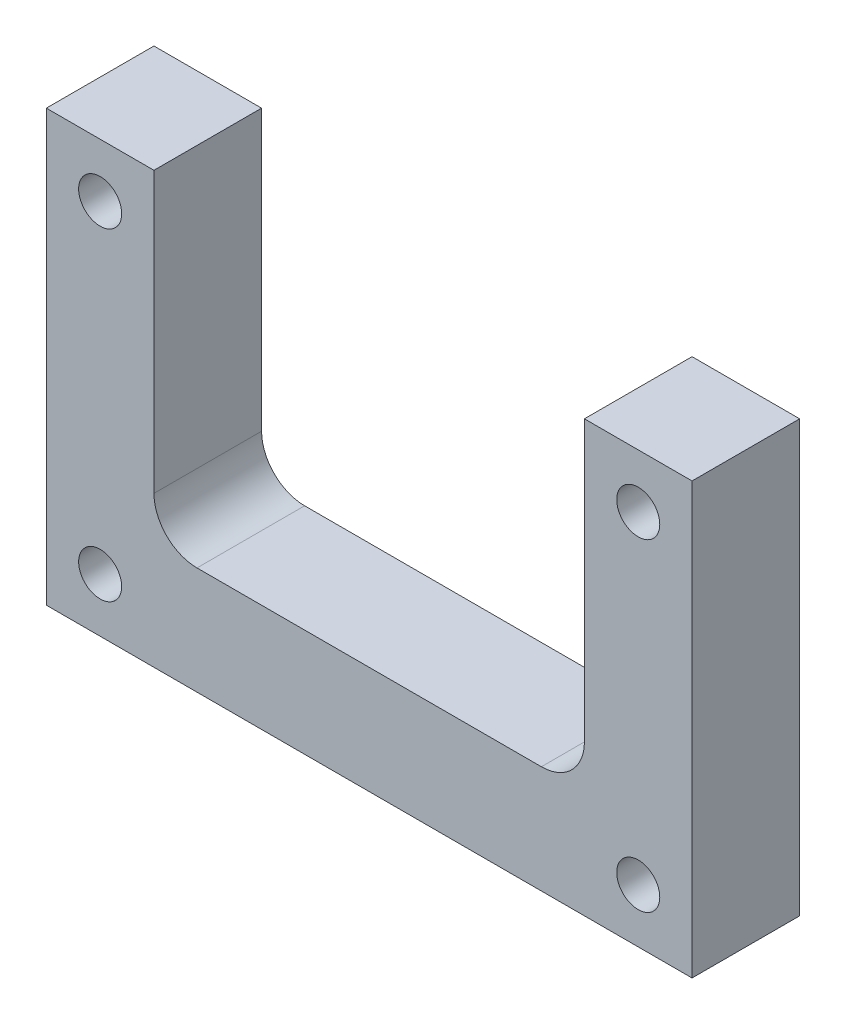
ISO-10303-21;
HEADER;
FILE_DESCRIPTION(('STEP AP214'),'2;1');
FILE_NAME('part.step','',(''),(''),'','','');
FILE_SCHEMA(('AUTOMOTIVE_DESIGN { 1 0 10303 214 1 1 1 1 }'));
ENDSEC;
DATA;
#1=APPLICATION_CONTEXT('core data for automotive mechanical design processes');
#2=APPLICATION_PROTOCOL_DEFINITION('international standard','automotive_design',2000,#1);
#3=PRODUCT_CONTEXT('',#1,'mechanical');
#4=PRODUCT('Part','Part','',(#3));
#5=PRODUCT_RELATED_PRODUCT_CATEGORY('part','',(#4));
#6=PRODUCT_DEFINITION_FORMATION('','',#4);
#7=PRODUCT_DEFINITION_CONTEXT('part definition',#1,'design');
#8=PRODUCT_DEFINITION('design','',#6,#7);
#9=PRODUCT_DEFINITION_SHAPE('','',#8);
#10=(LENGTH_UNIT() NAMED_UNIT(*) SI_UNIT(.MILLI.,.METRE.));
#11=(NAMED_UNIT(*) PLANE_ANGLE_UNIT() SI_UNIT($,.RADIAN.));
#12=(NAMED_UNIT(*) SI_UNIT($,.STERADIAN.) SOLID_ANGLE_UNIT());
#13=UNCERTAINTY_MEASURE_WITH_UNIT(LENGTH_MEASURE(1.E-05),#10,'distance_accuracy_value','');
#14=(GEOMETRIC_REPRESENTATION_CONTEXT(3) GLOBAL_UNCERTAINTY_ASSIGNED_CONTEXT((#13)) GLOBAL_UNIT_ASSIGNED_CONTEXT((#10,
#11,#12)) REPRESENTATION_CONTEXT('',''));
#15=CARTESIAN_POINT('',(0.,0.,0.));
#16=DIRECTION('',(0.,0.,1.));
#17=DIRECTION('',(1.,0.,0.));
#18=AXIS2_PLACEMENT_3D('',#15,#16,#17);
#19=CARTESIAN_POINT('',(38.1,25.4,12.7));
#20=DIRECTION('',(-1.,0.,0.));
#21=DIRECTION('',(0.,-1.,0.));
#22=AXIS2_PLACEMENT_3D('',#19,#20,#21);
#23=PLANE('',#22);
#24=DIRECTION('',(0.,1.,0.));
#25=VECTOR('',#24,1.);
#26=CARTESIAN_POINT('',(38.1,25.4,0.));
#27=LINE('',#26,#25);
#28=CARTESIAN_POINT('',(38.1,-25.4,0.));
#29=VERTEX_POINT('',#28);
#30=CARTESIAN_POINT('',(38.1,25.4,0.));
#31=VERTEX_POINT('',#30);
#32=EDGE_CURVE('E144',#29,#31,#27,.T.);
#33=ORIENTED_EDGE('',*,*,#32,.T.);
#34=DIRECTION('',(0.,0.,-1.));
#35=VECTOR('',#34,1.);
#36=CARTESIAN_POINT('',(38.1,25.4,12.7));
#37=LINE('',#36,#35);
#38=CARTESIAN_POINT('',(38.1,25.4,12.7));
#39=VERTEX_POINT('',#38);
#40=EDGE_CURVE('E123',#39,#31,#37,.T.);
#41=ORIENTED_EDGE('',*,*,#40,.F.);
#42=DIRECTION('',(0.,1.,0.));
#43=VECTOR('',#42,1.);
#44=CARTESIAN_POINT('',(38.1,25.4,12.7));
#45=LINE('',#44,#43);
#46=CARTESIAN_POINT('',(38.1,-25.4,12.7));
#47=VERTEX_POINT('',#46);
#48=EDGE_CURVE('E131',#47,#39,#45,.T.);
#49=ORIENTED_EDGE('',*,*,#48,.F.);
#50=DIRECTION('',(0.,0.,-1.));
#51=VECTOR('',#50,1.);
#52=CARTESIAN_POINT('',(38.1,-25.4,12.7));
#53=LINE('',#52,#51);
#54=EDGE_CURVE('E224',#47,#29,#53,.T.);
#55=ORIENTED_EDGE('',*,*,#54,.T.);
#56=EDGE_LOOP('',(#33,#41,#49,#55));
#57=FACE_BOUND('',#56,.T.);
#58=ADVANCED_FACE('F42',(#57),#23,.F.);
#59=CARTESIAN_POINT('',(25.4,25.4,12.7));
#60=DIRECTION('',(0.,-1.,0.));
#61=DIRECTION('',(0.,0.,-1.));
#62=AXIS2_PLACEMENT_3D('',#59,#60,#61);
#63=PLANE('',#62);
#64=DIRECTION('',(-1.,0.,0.));
#65=VECTOR('',#64,1.);
#66=CARTESIAN_POINT('',(25.4,25.4,0.));
#67=LINE('',#66,#65);
#68=CARTESIAN_POINT('',(25.4,25.4,0.));
#69=VERTEX_POINT('',#68);
#70=EDGE_CURVE('E227',#31,#69,#67,.T.);
#71=ORIENTED_EDGE('',*,*,#70,.T.);
#72=DIRECTION('',(0.,0.,-1.));
#73=VECTOR('',#72,1.);
#74=CARTESIAN_POINT('',(25.4,25.4,12.7));
#75=LINE('',#74,#73);
#76=CARTESIAN_POINT('',(25.4,25.4,12.7));
#77=VERTEX_POINT('',#76);
#78=EDGE_CURVE('E126',#77,#69,#75,.T.);
#79=ORIENTED_EDGE('',*,*,#78,.F.);
#80=DIRECTION('',(-1.,0.,0.));
#81=VECTOR('',#80,1.);
#82=CARTESIAN_POINT('',(25.4,25.4,12.7));
#83=LINE('',#82,#81);
#84=EDGE_CURVE('E119',#39,#77,#83,.T.);
#85=ORIENTED_EDGE('',*,*,#84,.F.);
#86=ORIENTED_EDGE('',*,*,#40,.T.);
#87=EDGE_LOOP('',(#71,#79,#85,#86));
#88=FACE_BOUND('',#87,.T.);
#89=ADVANCED_FACE('F121',(#88),#63,.F.);
#90=CARTESIAN_POINT('',(25.4,-12.7,12.7));
#91=DIRECTION('',(1.,0.,0.));
#92=DIRECTION('',(0.,1.,0.));
#93=AXIS2_PLACEMENT_3D('',#90,#91,#92);
#94=PLANE('',#93);
#95=DIRECTION('',(0.,-1.,0.));
#96=VECTOR('',#95,1.);
#97=CARTESIAN_POINT('',(25.4,-12.7,0.));
#98=LINE('',#97,#96);
#99=CARTESIAN_POINT('',(25.4,-7.62,0.));
#100=VERTEX_POINT('',#99);
#101=EDGE_CURVE('E201',#69,#100,#98,.T.);
#102=ORIENTED_EDGE('',*,*,#101,.T.);
#103=DIRECTION('',(0.,0.,-1.));
#104=VECTOR('',#103,1.);
#105=CARTESIAN_POINT('',(25.4,-7.62,12.7));
#106=LINE('',#105,#104);
#107=CARTESIAN_POINT('',(25.4,-7.62,12.7));
#108=VERTEX_POINT('',#107);
#109=EDGE_CURVE('E176',#100,#108,#106,.F.);
#110=ORIENTED_EDGE('',*,*,#109,.T.);
#111=DIRECTION('',(0.,-1.,0.));
#112=VECTOR('',#111,1.);
#113=CARTESIAN_POINT('',(25.4,-12.7,12.7));
#114=LINE('',#113,#112);
#115=EDGE_CURVE('E130',#77,#108,#114,.T.);
#116=ORIENTED_EDGE('',*,*,#115,.F.);
#117=ORIENTED_EDGE('',*,*,#78,.T.);
#118=EDGE_LOOP('',(#102,#110,#116,#117));
#119=FACE_BOUND('',#118,.T.);
#120=ADVANCED_FACE('F266',(#119),#94,.F.);
#121=CARTESIAN_POINT('',(-25.4,-12.7,12.7));
#122=DIRECTION('',(0.,-1.,0.));
#123=DIRECTION('',(1.,0.,0.));
#124=AXIS2_PLACEMENT_3D('',#121,#122,#123);
#125=PLANE('',#124);
#126=DIRECTION('',(-1.,0.,0.));
#127=VECTOR('',#126,1.);
#128=CARTESIAN_POINT('',(-25.4,-12.7,12.7));
#129=LINE('',#128,#127);
#130=CARTESIAN_POINT('',(20.32,-12.7,12.7));
#131=VERTEX_POINT('',#130);
#132=CARTESIAN_POINT('',(-20.32,-12.7,12.7));
#133=VERTEX_POINT('',#132);
#134=EDGE_CURVE('E211',#131,#133,#129,.T.);
#135=ORIENTED_EDGE('',*,*,#134,.F.);
#136=DIRECTION('',(0.,0.,-1.));
#137=VECTOR('',#136,1.);
#138=CARTESIAN_POINT('',(20.32,-12.7,0.));
#139=LINE('',#138,#137);
#140=CARTESIAN_POINT('',(20.32,-12.7,0.));
#141=VERTEX_POINT('',#140);
#142=EDGE_CURVE('E150',#131,#141,#139,.T.);
#143=ORIENTED_EDGE('',*,*,#142,.T.);
#144=DIRECTION('',(-1.,0.,0.));
#145=VECTOR('',#144,1.);
#146=CARTESIAN_POINT('',(-25.4,-12.7,0.));
#147=LINE('',#146,#145);
#148=CARTESIAN_POINT('',(-20.32,-12.7,0.));
#149=VERTEX_POINT('',#148);
#150=EDGE_CURVE('E193',#141,#149,#147,.T.);
#151=ORIENTED_EDGE('',*,*,#150,.T.);
#152=DIRECTION('',(0.,0.,-1.));
#153=VECTOR('',#152,1.);
#154=CARTESIAN_POINT('',(-20.32,-12.7,12.7));
#155=LINE('',#154,#153);
#156=EDGE_CURVE('E146',#149,#133,#155,.F.);
#157=ORIENTED_EDGE('',*,*,#156,.T.);
#158=EDGE_LOOP('',(#135,#143,#151,#157));
#159=FACE_BOUND('',#158,.T.);
#160=ADVANCED_FACE('F198',(#159),#125,.F.);
#161=CARTESIAN_POINT('',(-25.4,25.4,12.7));
#162=DIRECTION('',(-1.,0.,0.));
#163=DIRECTION('',(0.,-1.,0.));
#164=AXIS2_PLACEMENT_3D('',#161,#162,#163);
#165=PLANE('',#164);
#166=DIRECTION('',(0.,1.,0.));
#167=VECTOR('',#166,1.);
#168=CARTESIAN_POINT('',(-25.4,25.4,12.7));
#169=LINE('',#168,#167);
#170=CARTESIAN_POINT('',(-25.4,-7.62,12.7));
#171=VERTEX_POINT('',#170);
#172=CARTESIAN_POINT('',(-25.4,25.4,12.7));
#173=VERTEX_POINT('',#172);
#174=EDGE_CURVE('E207',#171,#173,#169,.T.);
#175=ORIENTED_EDGE('',*,*,#174,.F.);
#176=DIRECTION('',(0.,0.,-1.));
#177=VECTOR('',#176,1.);
#178=CARTESIAN_POINT('',(-25.4,-7.62,0.));
#179=LINE('',#178,#177);
#180=CARTESIAN_POINT('',(-25.4,-7.62,0.));
#181=VERTEX_POINT('',#180);
#182=EDGE_CURVE('E179',#171,#181,#179,.T.);
#183=ORIENTED_EDGE('',*,*,#182,.T.);
#184=DIRECTION('',(0.,1.,0.));
#185=VECTOR('',#184,1.);
#186=CARTESIAN_POINT('',(-25.4,25.4,0.));
#187=LINE('',#186,#185);
#188=CARTESIAN_POINT('',(-25.4,25.4,0.));
#189=VERTEX_POINT('',#188);
#190=EDGE_CURVE('E195',#181,#189,#187,.T.);
#191=ORIENTED_EDGE('',*,*,#190,.T.);
#192=DIRECTION('',(0.,0.,-1.));
#193=VECTOR('',#192,1.);
#194=CARTESIAN_POINT('',(-25.4,25.4,12.7));
#195=LINE('',#194,#193);
#196=EDGE_CURVE('E152',#173,#189,#195,.T.);
#197=ORIENTED_EDGE('',*,*,#196,.F.);
#198=EDGE_LOOP('',(#175,#183,#191,#197));
#199=FACE_BOUND('',#198,.T.);
#200=ADVANCED_FACE('F204',(#199),#165,.F.);
#201=CARTESIAN_POINT('',(-38.1,25.4,12.7));
#202=DIRECTION('',(0.,-1.,0.));
#203=DIRECTION('',(0.,0.,-1.));
#204=AXIS2_PLACEMENT_3D('',#201,#202,#203);
#205=PLANE('',#204);
#206=DIRECTION('',(-1.,0.,0.));
#207=VECTOR('',#206,1.);
#208=CARTESIAN_POINT('',(-38.1,25.4,0.));
#209=LINE('',#208,#207);
#210=CARTESIAN_POINT('',(-38.1,25.4,0.));
#211=VERTEX_POINT('',#210);
#212=EDGE_CURVE('E235',#189,#211,#209,.T.);
#213=ORIENTED_EDGE('',*,*,#212,.T.);
#214=DIRECTION('',(0.,0.,-1.));
#215=VECTOR('',#214,1.);
#216=CARTESIAN_POINT('',(-38.1,25.4,12.7));
#217=LINE('',#216,#215);
#218=CARTESIAN_POINT('',(-38.1,25.4,12.7));
#219=VERTEX_POINT('',#218);
#220=EDGE_CURVE('E249',#219,#211,#217,.T.);
#221=ORIENTED_EDGE('',*,*,#220,.F.);
#222=DIRECTION('',(-1.,0.,0.));
#223=VECTOR('',#222,1.);
#224=CARTESIAN_POINT('',(-38.1,25.4,12.7));
#225=LINE('',#224,#223);
#226=EDGE_CURVE('E210',#173,#219,#225,.T.);
#227=ORIENTED_EDGE('',*,*,#226,.F.);
#228=ORIENTED_EDGE('',*,*,#196,.T.);
#229=EDGE_LOOP('',(#213,#221,#227,#228));
#230=FACE_BOUND('',#229,.T.);
#231=ADVANCED_FACE('F254',(#230),#205,.F.);
#232=CARTESIAN_POINT('',(-38.1,25.4,12.7));
#233=DIRECTION('',(1.,0.,0.));
#234=DIRECTION('',(0.,1.,0.));
#235=AXIS2_PLACEMENT_3D('',#232,#233,#234);
#236=PLANE('',#235);
#237=DIRECTION('',(0.,-1.,0.));
#238=VECTOR('',#237,1.);
#239=CARTESIAN_POINT('',(-38.1,25.4,0.));
#240=LINE('',#239,#238);
#241=CARTESIAN_POINT('',(-38.1,-25.4,0.));
#242=VERTEX_POINT('',#241);
#243=EDGE_CURVE('E238',#211,#242,#240,.T.);
#244=ORIENTED_EDGE('',*,*,#243,.T.);
#245=DIRECTION('',(0.,0.,-1.));
#246=VECTOR('',#245,1.);
#247=CARTESIAN_POINT('',(-38.1,-25.4,12.7));
#248=LINE('',#247,#246);
#249=CARTESIAN_POINT('',(-38.1,-25.4,12.7));
#250=VERTEX_POINT('',#249);
#251=EDGE_CURVE('E245',#250,#242,#248,.T.);
#252=ORIENTED_EDGE('',*,*,#251,.F.);
#253=DIRECTION('',(0.,-1.,0.));
#254=VECTOR('',#253,1.);
#255=CARTESIAN_POINT('',(-38.1,25.4,12.7));
#256=LINE('',#255,#254);
#257=EDGE_CURVE('E215',#219,#250,#256,.T.);
#258=ORIENTED_EDGE('',*,*,#257,.F.);
#259=ORIENTED_EDGE('',*,*,#220,.T.);
#260=EDGE_LOOP('',(#244,#252,#258,#259));
#261=FACE_BOUND('',#260,.T.);
#262=ADVANCED_FACE('F260',(#261),#236,.F.);
#263=CARTESIAN_POINT('',(-38.1,-25.4,12.7));
#264=DIRECTION('',(0.,1.,0.));
#265=DIRECTION('',(0.,0.,1.));
#266=AXIS2_PLACEMENT_3D('',#263,#264,#265);
#267=PLANE('',#266);
#268=DIRECTION('',(1.,0.,0.));
#269=VECTOR('',#268,1.);
#270=CARTESIAN_POINT('',(-38.1,-25.4,0.));
#271=LINE('',#270,#269);
#272=EDGE_CURVE('E141',#242,#29,#271,.T.);
#273=ORIENTED_EDGE('',*,*,#272,.T.);
#274=ORIENTED_EDGE('',*,*,#54,.F.);
#275=DIRECTION('',(1.,0.,0.));
#276=VECTOR('',#275,1.);
#277=CARTESIAN_POINT('',(-38.1,-25.4,12.7));
#278=LINE('',#277,#276);
#279=EDGE_CURVE('E136',#250,#47,#278,.T.);
#280=ORIENTED_EDGE('',*,*,#279,.F.);
#281=ORIENTED_EDGE('',*,*,#251,.T.);
#282=EDGE_LOOP('',(#273,#274,#280,#281));
#283=FACE_BOUND('',#282,.T.);
#284=ADVANCED_FACE('F263',(#283),#267,.F.);
#285=CARTESIAN_POINT('',(0.,0.,12.7));
#286=DIRECTION('',(0.,0.,1.));
#287=DIRECTION('',(1.,0.,0.));
#288=AXIS2_PLACEMENT_3D('',#285,#286,#287);
#289=PLANE('',#288);
#290=CARTESIAN_POINT('',(-31.75,-19.05,12.7));
#291=DIRECTION('',(0.,0.,1.));
#292=DIRECTION('',(1.,0.,0.));
#293=AXIS2_PLACEMENT_3D('',#290,#291,#292);
#294=CIRCLE('',#293,2.54);
#295=CARTESIAN_POINT('',(-29.21,-19.05,12.7));
#296=VERTEX_POINT('',#295);
#297=EDGE_CURVE('E275',#296,#296,#294,.T.);
#298=ORIENTED_EDGE('',*,*,#297,.F.);
#299=EDGE_LOOP('',(#298));
#300=FACE_BOUND('',#299,.T.);
#301=CARTESIAN_POINT('',(31.75,-19.05,12.7));
#302=DIRECTION('',(0.,0.,1.));
#303=DIRECTION('',(1.,0.,0.));
#304=AXIS2_PLACEMENT_3D('',#301,#302,#303);
#305=CIRCLE('',#304,2.54);
#306=CARTESIAN_POINT('',(34.29,-19.05,12.7));
#307=VERTEX_POINT('',#306);
#308=EDGE_CURVE('E279',#307,#307,#305,.T.);
#309=ORIENTED_EDGE('',*,*,#308,.F.);
#310=EDGE_LOOP('',(#309));
#311=FACE_BOUND('',#310,.T.);
#312=CARTESIAN_POINT('',(31.75,19.05,12.7));
#313=DIRECTION('',(0.,0.,1.));
#314=DIRECTION('',(1.,0.,0.));
#315=AXIS2_PLACEMENT_3D('',#312,#313,#314);
#316=CIRCLE('',#315,2.54);
#317=CARTESIAN_POINT('',(34.29,19.05,12.7));
#318=VERTEX_POINT('',#317);
#319=EDGE_CURVE('E274',#318,#318,#316,.T.);
#320=ORIENTED_EDGE('',*,*,#319,.F.);
#321=EDGE_LOOP('',(#320));
#322=FACE_BOUND('',#321,.T.);
#323=CARTESIAN_POINT('',(-31.75,19.05,12.7));
#324=DIRECTION('',(0.,0.,1.));
#325=DIRECTION('',(1.,0.,0.));
#326=AXIS2_PLACEMENT_3D('',#323,#324,#325);
#327=CIRCLE('',#326,2.54);
#328=CARTESIAN_POINT('',(-29.21,19.05,12.7));
#329=VERTEX_POINT('',#328);
#330=EDGE_CURVE('E161',#329,#329,#327,.T.);
#331=ORIENTED_EDGE('',*,*,#330,.F.);
#332=EDGE_LOOP('',(#331));
#333=FACE_BOUND('',#332,.T.);
#334=ORIENTED_EDGE('',*,*,#48,.T.);
#335=ORIENTED_EDGE('',*,*,#84,.T.);
#336=ORIENTED_EDGE('',*,*,#115,.T.);
#337=CARTESIAN_POINT('',(20.32,-7.62,12.7));
#338=DIRECTION('',(0.,0.,1.));
#339=DIRECTION('',(1.,0.,0.));
#340=AXIS2_PLACEMENT_3D('',#337,#338,#339);
#341=CIRCLE('',#340,5.08);
#342=EDGE_CURVE('E185',#108,#131,#341,.F.);
#343=ORIENTED_EDGE('',*,*,#342,.T.);
#344=ORIENTED_EDGE('',*,*,#134,.T.);
#345=CARTESIAN_POINT('',(-20.32,-7.62,12.7));
#346=DIRECTION('',(0.,0.,1.));
#347=DIRECTION('',(1.,0.,0.));
#348=AXIS2_PLACEMENT_3D('',#345,#346,#347);
#349=CIRCLE('',#348,5.08);
#350=EDGE_CURVE('E11',#133,#171,#349,.F.);
#351=ORIENTED_EDGE('',*,*,#350,.T.);
#352=ORIENTED_EDGE('',*,*,#174,.T.);
#353=ORIENTED_EDGE('',*,*,#226,.T.);
#354=ORIENTED_EDGE('',*,*,#257,.T.);
#355=ORIENTED_EDGE('',*,*,#279,.T.);
#356=EDGE_LOOP('',(#334,#335,#336,#343,#344,#351,#352,#353,#354,#355));
#357=FACE_BOUND('',#356,.T.);
#358=ADVANCED_FACE('F134',(#300,#311,#322,#333,#357),#289,.T.);
#359=CARTESIAN_POINT('',(0.,0.,0.));
#360=DIRECTION('',(0.,0.,1.));
#361=DIRECTION('',(1.,0.,0.));
#362=AXIS2_PLACEMENT_3D('',#359,#360,#361);
#363=PLANE('',#362);
#364=CARTESIAN_POINT('',(-31.75,-19.05,0.));
#365=DIRECTION('',(0.,0.,1.));
#366=DIRECTION('',(1.,0.,0.));
#367=AXIS2_PLACEMENT_3D('',#364,#365,#366);
#368=CIRCLE('',#367,2.54);
#369=CARTESIAN_POINT('',(-29.21,-19.05,0.));
#370=VERTEX_POINT('',#369);
#371=EDGE_CURVE('E169',#370,#370,#368,.F.);
#372=ORIENTED_EDGE('',*,*,#371,.F.);
#373=EDGE_LOOP('',(#372));
#374=FACE_BOUND('',#373,.T.);
#375=CARTESIAN_POINT('',(31.75,-19.05,0.));
#376=DIRECTION('',(0.,0.,1.));
#377=DIRECTION('',(1.,0.,0.));
#378=AXIS2_PLACEMENT_3D('',#375,#376,#377);
#379=CIRCLE('',#378,2.54);
#380=CARTESIAN_POINT('',(34.29,-19.05,0.));
#381=VERTEX_POINT('',#380);
#382=EDGE_CURVE('E165',#381,#381,#379,.F.);
#383=ORIENTED_EDGE('',*,*,#382,.F.);
#384=EDGE_LOOP('',(#383));
#385=FACE_BOUND('',#384,.T.);
#386=CARTESIAN_POINT('',(31.75,19.05,0.));
#387=DIRECTION('',(0.,0.,1.));
#388=DIRECTION('',(1.,0.,0.));
#389=AXIS2_PLACEMENT_3D('',#386,#387,#388);
#390=CIRCLE('',#389,2.54);
#391=CARTESIAN_POINT('',(34.29,19.05,0.));
#392=VERTEX_POINT('',#391);
#393=EDGE_CURVE('E160',#392,#392,#390,.F.);
#394=ORIENTED_EDGE('',*,*,#393,.F.);
#395=EDGE_LOOP('',(#394));
#396=FACE_BOUND('',#395,.T.);
#397=CARTESIAN_POINT('',(-31.75,19.05,0.));
#398=DIRECTION('',(0.,0.,1.));
#399=DIRECTION('',(1.,0.,0.));
#400=AXIS2_PLACEMENT_3D('',#397,#398,#399);
#401=CIRCLE('',#400,2.54);
#402=CARTESIAN_POINT('',(-29.21,19.05,0.));
#403=VERTEX_POINT('',#402);
#404=EDGE_CURVE('E156',#403,#403,#401,.F.);
#405=ORIENTED_EDGE('',*,*,#404,.F.);
#406=EDGE_LOOP('',(#405));
#407=FACE_BOUND('',#406,.T.);
#408=ORIENTED_EDGE('',*,*,#32,.F.);
#409=ORIENTED_EDGE('',*,*,#272,.F.);
#410=ORIENTED_EDGE('',*,*,#243,.F.);
#411=ORIENTED_EDGE('',*,*,#212,.F.);
#412=ORIENTED_EDGE('',*,*,#190,.F.);
#413=CARTESIAN_POINT('',(-20.32,-7.62,0.));
#414=DIRECTION('',(0.,0.,1.));
#415=DIRECTION('',(1.,0.,0.));
#416=AXIS2_PLACEMENT_3D('',#413,#414,#415);
#417=CIRCLE('',#416,5.08);
#418=EDGE_CURVE('E51',#181,#149,#417,.T.);
#419=ORIENTED_EDGE('',*,*,#418,.T.);
#420=ORIENTED_EDGE('',*,*,#150,.F.);
#421=CARTESIAN_POINT('',(20.32,-7.62,0.));
#422=DIRECTION('',(0.,0.,1.));
#423=DIRECTION('',(1.,0.,0.));
#424=AXIS2_PLACEMENT_3D('',#421,#422,#423);
#425=CIRCLE('',#424,5.08);
#426=EDGE_CURVE('E182',#141,#100,#425,.T.);
#427=ORIENTED_EDGE('',*,*,#426,.T.);
#428=ORIENTED_EDGE('',*,*,#101,.F.);
#429=ORIENTED_EDGE('',*,*,#70,.F.);
#430=EDGE_LOOP('',(#408,#409,#410,#411,#412,#419,#420,#427,#428,#429));
#431=FACE_BOUND('',#430,.T.);
#432=ADVANCED_FACE('F192',(#374,#385,#396,#407,#431),#363,.F.);
#433=CARTESIAN_POINT('',(-31.75,19.05,12.7));
#434=DIRECTION('',(0.,0.,-1.));
#435=DIRECTION('',(-1.,0.,0.));
#436=AXIS2_PLACEMENT_3D('',#433,#434,#435);
#437=CYLINDRICAL_SURFACE('',#436,2.54);
#438=ORIENTED_EDGE('',*,*,#330,.T.);
#439=EDGE_LOOP('',(#438));
#440=FACE_BOUND('',#439,.T.);
#441=ORIENTED_EDGE('',*,*,#404,.T.);
#442=EDGE_LOOP('',(#441));
#443=FACE_BOUND('',#442,.T.);
#444=ADVANCED_FACE('F296',(#440,#443),#437,.F.);
#445=CARTESIAN_POINT('',(31.75,19.05,12.7));
#446=DIRECTION('',(0.,0.,-1.));
#447=DIRECTION('',(-1.,0.,0.));
#448=AXIS2_PLACEMENT_3D('',#445,#446,#447);
#449=CYLINDRICAL_SURFACE('',#448,2.54);
#450=ORIENTED_EDGE('',*,*,#319,.T.);
#451=EDGE_LOOP('',(#450));
#452=FACE_BOUND('',#451,.T.);
#453=ORIENTED_EDGE('',*,*,#393,.T.);
#454=EDGE_LOOP('',(#453));
#455=FACE_BOUND('',#454,.T.);
#456=ADVANCED_FACE('F287',(#452,#455),#449,.F.);
#457=CARTESIAN_POINT('',(31.75,-19.05,12.7));
#458=DIRECTION('',(0.,0.,-1.));
#459=DIRECTION('',(-1.,0.,0.));
#460=AXIS2_PLACEMENT_3D('',#457,#458,#459);
#461=CYLINDRICAL_SURFACE('',#460,2.54);
#462=ORIENTED_EDGE('',*,*,#308,.T.);
#463=EDGE_LOOP('',(#462));
#464=FACE_BOUND('',#463,.T.);
#465=ORIENTED_EDGE('',*,*,#382,.T.);
#466=EDGE_LOOP('',(#465));
#467=FACE_BOUND('',#466,.T.);
#468=ADVANCED_FACE('F325',(#464,#467),#461,.F.);
#469=CARTESIAN_POINT('',(-31.75,-19.05,12.7));
#470=DIRECTION('',(0.,0.,-1.));
#471=DIRECTION('',(-1.,0.,0.));
#472=AXIS2_PLACEMENT_3D('',#469,#470,#471);
#473=CYLINDRICAL_SURFACE('',#472,2.54);
#474=ORIENTED_EDGE('',*,*,#297,.T.);
#475=EDGE_LOOP('',(#474));
#476=FACE_BOUND('',#475,.T.);
#477=ORIENTED_EDGE('',*,*,#371,.T.);
#478=EDGE_LOOP('',(#477));
#479=FACE_BOUND('',#478,.T.);
#480=ADVANCED_FACE('F319',(#476,#479),#473,.F.);
#481=CARTESIAN_POINT('',(20.32,-7.62,12.7));
#482=DIRECTION('',(0.,0.,1.));
#483=DIRECTION('',(1.,0.,0.));
#484=AXIS2_PLACEMENT_3D('',#481,#482,#483);
#485=CYLINDRICAL_SURFACE('',#484,5.08);
#486=ORIENTED_EDGE('',*,*,#342,.F.);
#487=ORIENTED_EDGE('',*,*,#109,.F.);
#488=ORIENTED_EDGE('',*,*,#426,.F.);
#489=ORIENTED_EDGE('',*,*,#142,.F.);
#490=EDGE_LOOP('',(#486,#487,#488,#489));
#491=FACE_BOUND('',#490,.T.);
#492=ADVANCED_FACE('F317',(#491),#485,.F.);
#493=CARTESIAN_POINT('',(-20.32,-7.62,12.7));
#494=DIRECTION('',(0.,0.,1.));
#495=DIRECTION('',(1.,0.,0.));
#496=AXIS2_PLACEMENT_3D('',#493,#494,#495);
#497=CYLINDRICAL_SURFACE('',#496,5.08);
#498=ORIENTED_EDGE('',*,*,#350,.F.);
#499=ORIENTED_EDGE('',*,*,#156,.F.);
#500=ORIENTED_EDGE('',*,*,#418,.F.);
#501=ORIENTED_EDGE('',*,*,#182,.F.);
#502=EDGE_LOOP('',(#498,#499,#500,#501));
#503=FACE_BOUND('',#502,.T.);
#504=ADVANCED_FACE('F44',(#503),#497,.F.);
#505=CLOSED_SHELL('',(#58,#89,#120,#160,#200,#231,#262,#284,#358,#432,#444,#456,#468,#480,#492,#504));
#506=MANIFOLD_SOLID_BREP('B2',#505);
#507=ADVANCED_BREP_SHAPE_REPRESENTATION('',(#18,#506),#14);
#508=SHAPE_DEFINITION_REPRESENTATION(#9,#507);
ENDSEC;
END-ISO-10303-21;
